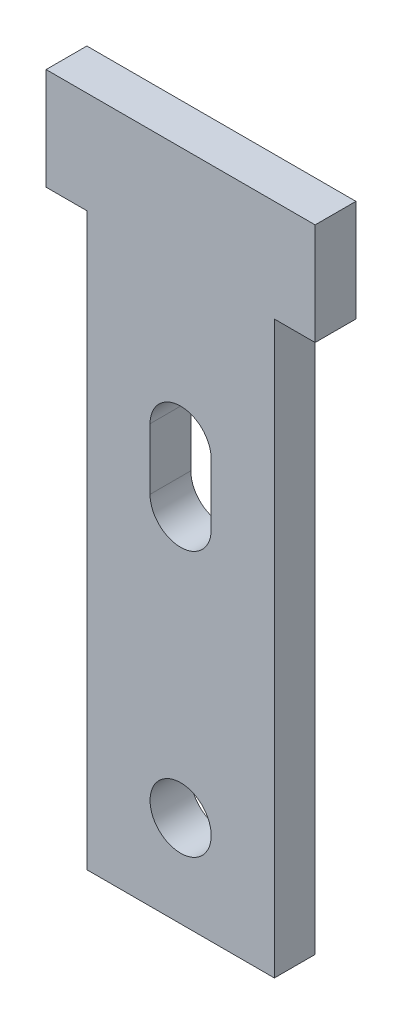
ISO-10303-21;
HEADER;
FILE_DESCRIPTION(('STEP AP214'),'2;1');
FILE_NAME('part.step','',(''),(''),'','','');
FILE_SCHEMA(('AUTOMOTIVE_DESIGN { 1 0 10303 214 1 1 1 1 }'));
ENDSEC;
DATA;
#1=APPLICATION_CONTEXT('core data for automotive mechanical design processes');
#2=APPLICATION_PROTOCOL_DEFINITION('international standard','automotive_design',2000,#1);
#3=PRODUCT_CONTEXT('',#1,'mechanical');
#4=PRODUCT('Part','Part','',(#3));
#5=PRODUCT_RELATED_PRODUCT_CATEGORY('part','',(#4));
#6=PRODUCT_DEFINITION_FORMATION('','',#4);
#7=PRODUCT_DEFINITION_CONTEXT('part definition',#1,'design');
#8=PRODUCT_DEFINITION('design','',#6,#7);
#9=PRODUCT_DEFINITION_SHAPE('','',#8);
#10=(LENGTH_UNIT() NAMED_UNIT(*) SI_UNIT(.MILLI.,.METRE.));
#11=(NAMED_UNIT(*) PLANE_ANGLE_UNIT() SI_UNIT($,.RADIAN.));
#12=(NAMED_UNIT(*) SI_UNIT($,.STERADIAN.) SOLID_ANGLE_UNIT());
#13=UNCERTAINTY_MEASURE_WITH_UNIT(LENGTH_MEASURE(1.E-05),#10,'distance_accuracy_value','');
#14=(GEOMETRIC_REPRESENTATION_CONTEXT(3) GLOBAL_UNCERTAINTY_ASSIGNED_CONTEXT((#13)) GLOBAL_UNIT_ASSIGNED_CONTEXT((#10,
#11,#12)) REPRESENTATION_CONTEXT('',''));
#15=CARTESIAN_POINT('',(0.,0.,0.));
#16=DIRECTION('',(0.,0.,1.));
#17=DIRECTION('',(1.,0.,0.));
#18=AXIS2_PLACEMENT_3D('',#15,#16,#17);
#19=CARTESIAN_POINT('',(5.842,35.56,1.27));
#20=DIRECTION('',(-1.,0.,0.));
#21=DIRECTION('',(0.,0.,1.));
#22=AXIS2_PLACEMENT_3D('',#19,#20,#21);
#23=PLANE('',#22);
#24=DIRECTION('',(0.,0.,-1.));
#25=VECTOR('',#24,1.);
#26=CARTESIAN_POINT('',(5.842,0.,1.27));
#27=LINE('',#26,#25);
#28=CARTESIAN_POINT('',(5.842,0.,1.27));
#29=VERTEX_POINT('',#28);
#30=CARTESIAN_POINT('',(5.842,0.,-1.27));
#31=VERTEX_POINT('',#30);
#32=EDGE_CURVE('E191',#29,#31,#27,.T.);
#33=ORIENTED_EDGE('',*,*,#32,.T.);
#34=DIRECTION('',(0.,-1.,0.));
#35=VECTOR('',#34,1.);
#36=CARTESIAN_POINT('',(5.842,35.56,-1.27));
#37=LINE('',#36,#35);
#38=CARTESIAN_POINT('',(5.842,35.56,-1.27));
#39=VERTEX_POINT('',#38);
#40=EDGE_CURVE('E11',#39,#31,#37,.T.);
#41=ORIENTED_EDGE('',*,*,#40,.F.);
#42=DIRECTION('',(0.,0.,-1.));
#43=VECTOR('',#42,1.);
#44=CARTESIAN_POINT('',(5.842,35.56,1.27));
#45=LINE('',#44,#43);
#46=CARTESIAN_POINT('',(5.842,35.56,1.27));
#47=VERTEX_POINT('',#46);
#48=EDGE_CURVE('E227',#47,#39,#45,.T.);
#49=ORIENTED_EDGE('',*,*,#48,.F.);
#50=DIRECTION('',(0.,-1.,0.));
#51=VECTOR('',#50,1.);
#52=CARTESIAN_POINT('',(5.842,35.56,1.27));
#53=LINE('',#52,#51);
#54=EDGE_CURVE('E236',#47,#29,#53,.T.);
#55=ORIENTED_EDGE('',*,*,#54,.T.);
#56=EDGE_LOOP('',(#33,#41,#49,#55));
#57=FACE_BOUND('',#56,.T.);
#58=ADVANCED_FACE('F41',(#57),#23,.F.);
#59=CARTESIAN_POINT('',(-5.842,35.56,-1.27));
#60=DIRECTION('',(0.,0.,1.));
#61=DIRECTION('',(1.,0.,0.));
#62=AXIS2_PLACEMENT_3D('',#59,#60,#61);
#63=PLANE('',#62);
#64=CARTESIAN_POINT('',(0.,5.715,-1.27));
#65=DIRECTION('',(0.,0.,1.));
#66=DIRECTION('',(1.,0.,0.));
#67=AXIS2_PLACEMENT_3D('',#64,#65,#66);
#68=CIRCLE('',#67,1.905);
#69=CARTESIAN_POINT('',(1.905,5.715,-1.27));
#70=VERTEX_POINT('',#69);
#71=EDGE_CURVE('E197',#70,#70,#68,.F.);
#72=ORIENTED_EDGE('',*,*,#71,.F.);
#73=EDGE_LOOP('',(#72));
#74=FACE_BOUND('',#73,.T.);
#75=DIRECTION('',(0.,-1.,0.));
#76=VECTOR('',#75,1.);
#77=CARTESIAN_POINT('',(1.905,26.035,-1.27));
#78=LINE('',#77,#76);
#79=CARTESIAN_POINT('',(1.905,26.035,-1.27));
#80=VERTEX_POINT('',#79);
#81=CARTESIAN_POINT('',(1.905,22.225,-1.27));
#82=VERTEX_POINT('',#81);
#83=EDGE_CURVE('E152',#80,#82,#78,.T.);
#84=ORIENTED_EDGE('',*,*,#83,.F.);
#85=CARTESIAN_POINT('',(0.,26.035,-1.27));
#86=DIRECTION('',(0.,0.,1.));
#87=DIRECTION('',(1.,0.,0.));
#88=AXIS2_PLACEMENT_3D('',#85,#86,#87);
#89=CIRCLE('',#88,1.905);
#90=CARTESIAN_POINT('',(-1.905,26.035,-1.27));
#91=VERTEX_POINT('',#90);
#92=EDGE_CURVE('E132',#91,#80,#89,.F.);
#93=ORIENTED_EDGE('',*,*,#92,.F.);
#94=DIRECTION('',(0.,1.,0.));
#95=VECTOR('',#94,1.);
#96=CARTESIAN_POINT('',(-1.905,26.035,-1.27));
#97=LINE('',#96,#95);
#98=CARTESIAN_POINT('',(-1.905,22.225,-1.27));
#99=VERTEX_POINT('',#98);
#100=EDGE_CURVE('E142',#99,#91,#97,.T.);
#101=ORIENTED_EDGE('',*,*,#100,.F.);
#102=CARTESIAN_POINT('',(0.,22.225,-1.27));
#103=DIRECTION('',(0.,0.,1.));
#104=DIRECTION('',(1.,0.,0.));
#105=AXIS2_PLACEMENT_3D('',#102,#103,#104);
#106=CIRCLE('',#105,1.905);
#107=EDGE_CURVE('E56',#82,#99,#106,.F.);
#108=ORIENTED_EDGE('',*,*,#107,.F.);
#109=EDGE_LOOP('',(#84,#93,#101,#108));
#110=FACE_BOUND('',#109,.T.);
#111=DIRECTION('',(-1.,0.,0.));
#112=VECTOR('',#111,1.);
#113=CARTESIAN_POINT('',(-5.842,0.,-1.27));
#114=LINE('',#113,#112);
#115=CARTESIAN_POINT('',(-5.842,0.,-1.27));
#116=VERTEX_POINT('',#115);
#117=EDGE_CURVE('E240',#31,#116,#114,.T.);
#118=ORIENTED_EDGE('',*,*,#117,.T.);
#119=DIRECTION('',(0.,-1.,0.));
#120=VECTOR('',#119,1.);
#121=CARTESIAN_POINT('',(-5.842,35.56,-1.27));
#122=LINE('',#121,#120);
#123=CARTESIAN_POINT('',(-5.842,35.56,-1.27));
#124=VERTEX_POINT('',#123);
#125=EDGE_CURVE('E49',#124,#116,#122,.T.);
#126=ORIENTED_EDGE('',*,*,#125,.F.);
#127=DIRECTION('',(1.,0.,0.));
#128=VECTOR('',#127,1.);
#129=CARTESIAN_POINT('',(0.,35.56,-1.27));
#130=LINE('',#129,#128);
#131=CARTESIAN_POINT('',(-8.382,35.56,-1.27));
#132=VERTEX_POINT('',#131);
#133=EDGE_CURVE('E178',#132,#124,#130,.T.);
#134=ORIENTED_EDGE('',*,*,#133,.F.);
#135=DIRECTION('',(0.,-1.,0.));
#136=VECTOR('',#135,1.);
#137=CARTESIAN_POINT('',(-8.38199999999998,0.,-1.27));
#138=LINE('',#137,#136);
#139=CARTESIAN_POINT('',(-8.382,41.91,-1.27));
#140=VERTEX_POINT('',#139);
#141=EDGE_CURVE('E214',#140,#132,#138,.T.);
#142=ORIENTED_EDGE('',*,*,#141,.F.);
#143=DIRECTION('',(-1.,0.,0.));
#144=VECTOR('',#143,1.);
#145=CARTESIAN_POINT('',(0.,41.91,-1.27));
#146=LINE('',#145,#144);
#147=CARTESIAN_POINT('',(8.382,41.91,-1.27));
#148=VERTEX_POINT('',#147);
#149=EDGE_CURVE('E187',#148,#140,#146,.T.);
#150=ORIENTED_EDGE('',*,*,#149,.F.);
#151=DIRECTION('',(0.,-1.,0.));
#152=VECTOR('',#151,1.);
#153=CARTESIAN_POINT('',(8.382,0.,-1.27));
#154=LINE('',#153,#152);
#155=CARTESIAN_POINT('',(8.382,35.56,-1.27));
#156=VERTEX_POINT('',#155);
#157=EDGE_CURVE('E182',#148,#156,#154,.T.);
#158=ORIENTED_EDGE('',*,*,#157,.T.);
#159=EDGE_CURVE('E183',#39,#156,#130,.T.);
#160=ORIENTED_EDGE('',*,*,#159,.F.);
#161=ORIENTED_EDGE('',*,*,#40,.T.);
#162=EDGE_LOOP('',(#118,#126,#134,#142,#150,#158,#160,#161));
#163=FACE_BOUND('',#162,.T.);
#164=ADVANCED_FACE('F149',(#74,#110,#163),#63,.F.);
#165=CARTESIAN_POINT('',(-5.842,35.56,1.27));
#166=DIRECTION('',(1.,0.,0.));
#167=DIRECTION('',(0.,0.,-1.));
#168=AXIS2_PLACEMENT_3D('',#165,#166,#167);
#169=PLANE('',#168);
#170=DIRECTION('',(0.,0.,1.));
#171=VECTOR('',#170,1.);
#172=CARTESIAN_POINT('',(-5.842,0.,1.27));
#173=LINE('',#172,#171);
#174=CARTESIAN_POINT('',(-5.842,0.,1.27));
#175=VERTEX_POINT('',#174);
#176=EDGE_CURVE('E243',#116,#175,#173,.T.);
#177=ORIENTED_EDGE('',*,*,#176,.T.);
#178=DIRECTION('',(0.,-1.,0.));
#179=VECTOR('',#178,1.);
#180=CARTESIAN_POINT('',(-5.842,35.56,1.27));
#181=LINE('',#180,#179);
#182=CARTESIAN_POINT('',(-5.842,35.56,1.27));
#183=VERTEX_POINT('',#182);
#184=EDGE_CURVE('E251',#183,#175,#181,.T.);
#185=ORIENTED_EDGE('',*,*,#184,.F.);
#186=DIRECTION('',(0.,0.,1.));
#187=VECTOR('',#186,1.);
#188=CARTESIAN_POINT('',(-5.842,35.56,1.27));
#189=LINE('',#188,#187);
#190=EDGE_CURVE('E231',#124,#183,#189,.T.);
#191=ORIENTED_EDGE('',*,*,#190,.F.);
#192=ORIENTED_EDGE('',*,*,#125,.T.);
#193=EDGE_LOOP('',(#177,#185,#191,#192));
#194=FACE_BOUND('',#193,.T.);
#195=ADVANCED_FACE('F259',(#194),#169,.F.);
#196=CARTESIAN_POINT('',(-5.842,35.56,1.27));
#197=DIRECTION('',(0.,0.,-1.));
#198=DIRECTION('',(-1.,0.,0.));
#199=AXIS2_PLACEMENT_3D('',#196,#197,#198);
#200=PLANE('',#199);
#201=CARTESIAN_POINT('',(0.,5.715,1.27));
#202=DIRECTION('',(0.,0.,1.));
#203=DIRECTION('',(1.,0.,0.));
#204=AXIS2_PLACEMENT_3D('',#201,#202,#203);
#205=CIRCLE('',#204,1.905);
#206=CARTESIAN_POINT('',(1.905,5.715,1.27));
#207=VERTEX_POINT('',#206);
#208=EDGE_CURVE('E146',#207,#207,#205,.T.);
#209=ORIENTED_EDGE('',*,*,#208,.F.);
#210=EDGE_LOOP('',(#209));
#211=FACE_BOUND('',#210,.T.);
#212=DIRECTION('',(0.,-1.,0.));
#213=VECTOR('',#212,1.);
#214=CARTESIAN_POINT('',(-1.905,26.035,1.27));
#215=LINE('',#214,#213);
#216=CARTESIAN_POINT('',(-1.905,26.035,1.27));
#217=VERTEX_POINT('',#216);
#218=CARTESIAN_POINT('',(-1.905,22.225,1.27));
#219=VERTEX_POINT('',#218);
#220=EDGE_CURVE('E157',#217,#219,#215,.T.);
#221=ORIENTED_EDGE('',*,*,#220,.F.);
#222=CARTESIAN_POINT('',(0.,26.035,1.27));
#223=DIRECTION('',(0.,0.,1.));
#224=DIRECTION('',(1.,0.,0.));
#225=AXIS2_PLACEMENT_3D('',#222,#223,#224);
#226=CIRCLE('',#225,1.905);
#227=CARTESIAN_POINT('',(1.905,26.035,1.27));
#228=VERTEX_POINT('',#227);
#229=EDGE_CURVE('E64',#228,#217,#226,.T.);
#230=ORIENTED_EDGE('',*,*,#229,.F.);
#231=DIRECTION('',(0.,1.,0.));
#232=VECTOR('',#231,1.);
#233=CARTESIAN_POINT('',(1.905,26.035,1.27));
#234=LINE('',#233,#232);
#235=CARTESIAN_POINT('',(1.905,22.225,1.27));
#236=VERTEX_POINT('',#235);
#237=EDGE_CURVE('E139',#236,#228,#234,.T.);
#238=ORIENTED_EDGE('',*,*,#237,.F.);
#239=CARTESIAN_POINT('',(0.,22.225,1.27));
#240=DIRECTION('',(0.,0.,1.));
#241=DIRECTION('',(1.,0.,0.));
#242=AXIS2_PLACEMENT_3D('',#239,#240,#241);
#243=CIRCLE('',#242,1.905);
#244=EDGE_CURVE('E164',#219,#236,#243,.T.);
#245=ORIENTED_EDGE('',*,*,#244,.F.);
#246=EDGE_LOOP('',(#221,#230,#238,#245));
#247=FACE_BOUND('',#246,.T.);
#248=DIRECTION('',(1.,0.,0.));
#249=VECTOR('',#248,1.);
#250=CARTESIAN_POINT('',(-5.842,0.,1.27));
#251=LINE('',#250,#249);
#252=EDGE_CURVE('E232',#175,#29,#251,.T.);
#253=ORIENTED_EDGE('',*,*,#252,.T.);
#254=ORIENTED_EDGE('',*,*,#54,.F.);
#255=DIRECTION('',(-1.,0.,0.));
#256=VECTOR('',#255,1.);
#257=CARTESIAN_POINT('',(0.,35.56,1.27));
#258=LINE('',#257,#256);
#259=CARTESIAN_POINT('',(8.382,35.56,1.27));
#260=VERTEX_POINT('',#259);
#261=EDGE_CURVE('E202',#260,#47,#258,.T.);
#262=ORIENTED_EDGE('',*,*,#261,.F.);
#263=DIRECTION('',(0.,1.,0.));
#264=VECTOR('',#263,1.);
#265=CARTESIAN_POINT('',(8.382,0.,1.27));
#266=LINE('',#265,#264);
#267=CARTESIAN_POINT('',(8.382,41.91,1.27));
#268=VERTEX_POINT('',#267);
#269=EDGE_CURVE('E206',#260,#268,#266,.T.);
#270=ORIENTED_EDGE('',*,*,#269,.T.);
#271=DIRECTION('',(1.,0.,0.));
#272=VECTOR('',#271,1.);
#273=CARTESIAN_POINT('',(0.,41.91,1.27));
#274=LINE('',#273,#272);
#275=CARTESIAN_POINT('',(-8.382,41.91,1.27));
#276=VERTEX_POINT('',#275);
#277=EDGE_CURVE('E192',#276,#268,#274,.T.);
#278=ORIENTED_EDGE('',*,*,#277,.F.);
#279=DIRECTION('',(0.,1.,0.));
#280=VECTOR('',#279,1.);
#281=CARTESIAN_POINT('',(-8.38199999999998,0.,1.27));
#282=LINE('',#281,#280);
#283=CARTESIAN_POINT('',(-8.382,35.56,1.27));
#284=VERTEX_POINT('',#283);
#285=EDGE_CURVE('E196',#284,#276,#282,.T.);
#286=ORIENTED_EDGE('',*,*,#285,.F.);
#287=EDGE_CURVE('E201',#183,#284,#258,.T.);
#288=ORIENTED_EDGE('',*,*,#287,.F.);
#289=ORIENTED_EDGE('',*,*,#184,.T.);
#290=EDGE_LOOP('',(#253,#254,#262,#270,#278,#286,#288,#289));
#291=FACE_BOUND('',#290,.T.);
#292=ADVANCED_FACE('F265',(#211,#247,#291),#200,.F.);
#293=CARTESIAN_POINT('',(0.,0.,0.));
#294=DIRECTION('',(0.,-1.,0.));
#295=DIRECTION('',(0.,0.,-1.));
#296=AXIS2_PLACEMENT_3D('',#293,#294,#295);
#297=PLANE('',#296);
#298=ORIENTED_EDGE('',*,*,#32,.F.);
#299=ORIENTED_EDGE('',*,*,#252,.F.);
#300=ORIENTED_EDGE('',*,*,#176,.F.);
#301=ORIENTED_EDGE('',*,*,#117,.F.);
#302=EDGE_LOOP('',(#298,#299,#300,#301));
#303=FACE_BOUND('',#302,.T.);
#304=ADVANCED_FACE('F263',(#303),#297,.T.);
#305=CARTESIAN_POINT('',(0.,35.56,-19.1963547884114));
#306=DIRECTION('',(0.,1.,0.));
#307=DIRECTION('',(0.,0.,1.));
#308=AXIS2_PLACEMENT_3D('',#305,#306,#307);
#309=PLANE('',#308);
#310=ORIENTED_EDGE('',*,*,#261,.T.);
#311=ORIENTED_EDGE('',*,*,#48,.T.);
#312=ORIENTED_EDGE('',*,*,#159,.T.);
#313=DIRECTION('',(0.,0.,1.));
#314=VECTOR('',#313,1.);
#315=CARTESIAN_POINT('',(8.382,35.56,-19.1963547884114));
#316=LINE('',#315,#314);
#317=EDGE_CURVE('E215',#156,#260,#316,.T.);
#318=ORIENTED_EDGE('',*,*,#317,.T.);
#319=EDGE_LOOP('',(#310,#311,#312,#318));
#320=FACE_BOUND('',#319,.T.);
#321=ADVANCED_FACE('F272',(#320),#309,.F.);
#322=ORIENTED_EDGE('',*,*,#133,.T.);
#323=ORIENTED_EDGE('',*,*,#190,.T.);
#324=ORIENTED_EDGE('',*,*,#287,.T.);
#325=DIRECTION('',(0.,0.,1.));
#326=VECTOR('',#325,1.);
#327=CARTESIAN_POINT('',(-8.382,35.56,-19.1963547884114));
#328=LINE('',#327,#326);
#329=EDGE_CURVE('E218',#132,#284,#328,.T.);
#330=ORIENTED_EDGE('',*,*,#329,.F.);
#331=EDGE_LOOP('',(#322,#323,#324,#330));
#332=FACE_BOUND('',#331,.T.);
#333=ADVANCED_FACE('F288',(#332),#309,.F.);
#334=CARTESIAN_POINT('',(-8.38199999999998,0.,-19.1963547884114));
#335=DIRECTION('',(1.,0.,0.));
#336=DIRECTION('',(0.,1.,0.));
#337=AXIS2_PLACEMENT_3D('',#334,#335,#336);
#338=PLANE('',#337);
#339=DIRECTION('',(0.,0.,1.));
#340=VECTOR('',#339,1.);
#341=CARTESIAN_POINT('',(-8.382,41.91,-19.1963547884114));
#342=LINE('',#341,#340);
#343=EDGE_CURVE('E210',#140,#276,#342,.T.);
#344=ORIENTED_EDGE('',*,*,#343,.F.);
#345=ORIENTED_EDGE('',*,*,#141,.T.);
#346=ORIENTED_EDGE('',*,*,#329,.T.);
#347=ORIENTED_EDGE('',*,*,#285,.T.);
#348=EDGE_LOOP('',(#344,#345,#346,#347));
#349=FACE_BOUND('',#348,.T.);
#350=ADVANCED_FACE('F285',(#349),#338,.F.);
#351=CARTESIAN_POINT('',(8.382,0.,-19.1963547884114));
#352=DIRECTION('',(1.,0.,0.));
#353=DIRECTION('',(0.,0.,-1.));
#354=AXIS2_PLACEMENT_3D('',#351,#352,#353);
#355=PLANE('',#354);
#356=ORIENTED_EDGE('',*,*,#157,.F.);
#357=DIRECTION('',(0.,0.,1.));
#358=VECTOR('',#357,1.);
#359=CARTESIAN_POINT('',(8.382,41.91,-19.1963547884114));
#360=LINE('',#359,#358);
#361=EDGE_CURVE('E211',#148,#268,#360,.T.);
#362=ORIENTED_EDGE('',*,*,#361,.T.);
#363=ORIENTED_EDGE('',*,*,#269,.F.);
#364=ORIENTED_EDGE('',*,*,#317,.F.);
#365=EDGE_LOOP('',(#356,#362,#363,#364));
#366=FACE_BOUND('',#365,.T.);
#367=ADVANCED_FACE('F278',(#366),#355,.T.);
#368=CARTESIAN_POINT('',(0.,41.91,-19.1963547884114));
#369=DIRECTION('',(0.,-1.,0.));
#370=DIRECTION('',(0.,0.,-1.));
#371=AXIS2_PLACEMENT_3D('',#368,#369,#370);
#372=PLANE('',#371);
#373=ORIENTED_EDGE('',*,*,#361,.F.);
#374=ORIENTED_EDGE('',*,*,#149,.T.);
#375=ORIENTED_EDGE('',*,*,#343,.T.);
#376=ORIENTED_EDGE('',*,*,#277,.T.);
#377=EDGE_LOOP('',(#373,#374,#375,#376));
#378=FACE_BOUND('',#377,.T.);
#379=ADVANCED_FACE('F281',(#378),#372,.F.);
#380=CARTESIAN_POINT('',(0.,26.035,-1.271));
#381=DIRECTION('',(0.,0.,1.));
#382=DIRECTION('',(1.,0.,0.));
#383=AXIS2_PLACEMENT_3D('',#380,#381,#382);
#384=CYLINDRICAL_SURFACE('',#383,1.905);
#385=ORIENTED_EDGE('',*,*,#92,.T.);
#386=DIRECTION('',(0.,0.,1.));
#387=VECTOR('',#386,1.);
#388=CARTESIAN_POINT('',(1.905,26.035,-1.271));
#389=LINE('',#388,#387);
#390=EDGE_CURVE('E147',#80,#228,#389,.T.);
#391=ORIENTED_EDGE('',*,*,#390,.T.);
#392=ORIENTED_EDGE('',*,*,#229,.T.);
#393=DIRECTION('',(0.,0.,1.));
#394=VECTOR('',#393,1.);
#395=CARTESIAN_POINT('',(-1.905,26.035,-1.271));
#396=LINE('',#395,#394);
#397=EDGE_CURVE('E128',#91,#217,#396,.T.);
#398=ORIENTED_EDGE('',*,*,#397,.F.);
#399=EDGE_LOOP('',(#385,#391,#392,#398));
#400=FACE_BOUND('',#399,.T.);
#401=ADVANCED_FACE('F130',(#400),#384,.F.);
#402=CARTESIAN_POINT('',(1.905,26.035,-1.271));
#403=DIRECTION('',(1.,0.,0.));
#404=DIRECTION('',(0.,1.,0.));
#405=AXIS2_PLACEMENT_3D('',#402,#403,#404);
#406=PLANE('',#405);
#407=ORIENTED_EDGE('',*,*,#83,.T.);
#408=DIRECTION('',(0.,0.,1.));
#409=VECTOR('',#408,1.);
#410=CARTESIAN_POINT('',(1.905,22.225,-1.271));
#411=LINE('',#410,#409);
#412=EDGE_CURVE('E173',#82,#236,#411,.T.);
#413=ORIENTED_EDGE('',*,*,#412,.T.);
#414=ORIENTED_EDGE('',*,*,#237,.T.);
#415=ORIENTED_EDGE('',*,*,#390,.F.);
#416=EDGE_LOOP('',(#407,#413,#414,#415));
#417=FACE_BOUND('',#416,.T.);
#418=ADVANCED_FACE('F309',(#417),#406,.F.);
#419=CARTESIAN_POINT('',(0.,22.225,-1.271));
#420=DIRECTION('',(0.,0.,1.));
#421=DIRECTION('',(1.,0.,0.));
#422=AXIS2_PLACEMENT_3D('',#419,#420,#421);
#423=CYLINDRICAL_SURFACE('',#422,1.905);
#424=ORIENTED_EDGE('',*,*,#107,.T.);
#425=DIRECTION('',(0.,0.,1.));
#426=VECTOR('',#425,1.);
#427=CARTESIAN_POINT('',(-1.905,22.225,-1.271));
#428=LINE('',#427,#426);
#429=EDGE_CURVE('E138',#99,#219,#428,.T.);
#430=ORIENTED_EDGE('',*,*,#429,.T.);
#431=ORIENTED_EDGE('',*,*,#244,.T.);
#432=ORIENTED_EDGE('',*,*,#412,.F.);
#433=EDGE_LOOP('',(#424,#430,#431,#432));
#434=FACE_BOUND('',#433,.T.);
#435=ADVANCED_FACE('F307',(#434),#423,.F.);
#436=CARTESIAN_POINT('',(-1.905,26.035,-1.271));
#437=DIRECTION('',(-1.,0.,0.));
#438=DIRECTION('',(0.,-1.,0.));
#439=AXIS2_PLACEMENT_3D('',#436,#437,#438);
#440=PLANE('',#439);
#441=ORIENTED_EDGE('',*,*,#100,.T.);
#442=ORIENTED_EDGE('',*,*,#397,.T.);
#443=ORIENTED_EDGE('',*,*,#220,.T.);
#444=ORIENTED_EDGE('',*,*,#429,.F.);
#445=EDGE_LOOP('',(#441,#442,#443,#444));
#446=FACE_BOUND('',#445,.T.);
#447=ADVANCED_FACE('F143',(#446),#440,.F.);
#448=CARTESIAN_POINT('',(0.,5.715,-1.271));
#449=DIRECTION('',(0.,0.,1.));
#450=DIRECTION('',(1.,0.,0.));
#451=AXIS2_PLACEMENT_3D('',#448,#449,#450);
#452=CYLINDRICAL_SURFACE('',#451,1.905);
#453=ORIENTED_EDGE('',*,*,#208,.T.);
#454=EDGE_LOOP('',(#453));
#455=FACE_BOUND('',#454,.T.);
#456=ORIENTED_EDGE('',*,*,#71,.T.);
#457=EDGE_LOOP('',(#456));
#458=FACE_BOUND('',#457,.T.);
#459=ADVANCED_FACE('F299',(#455,#458),#452,.F.);
#460=CLOSED_SHELL('',(#58,#164,#195,#292,#304,#321,#333,#350,#367,#379,#401,#418,#435,#447,#459));
#461=MANIFOLD_SOLID_BREP('B2',#460);
#462=ADVANCED_BREP_SHAPE_REPRESENTATION('',(#18,#461),#14);
#463=SHAPE_DEFINITION_REPRESENTATION(#9,#462);
ENDSEC;
END-ISO-10303-21;
